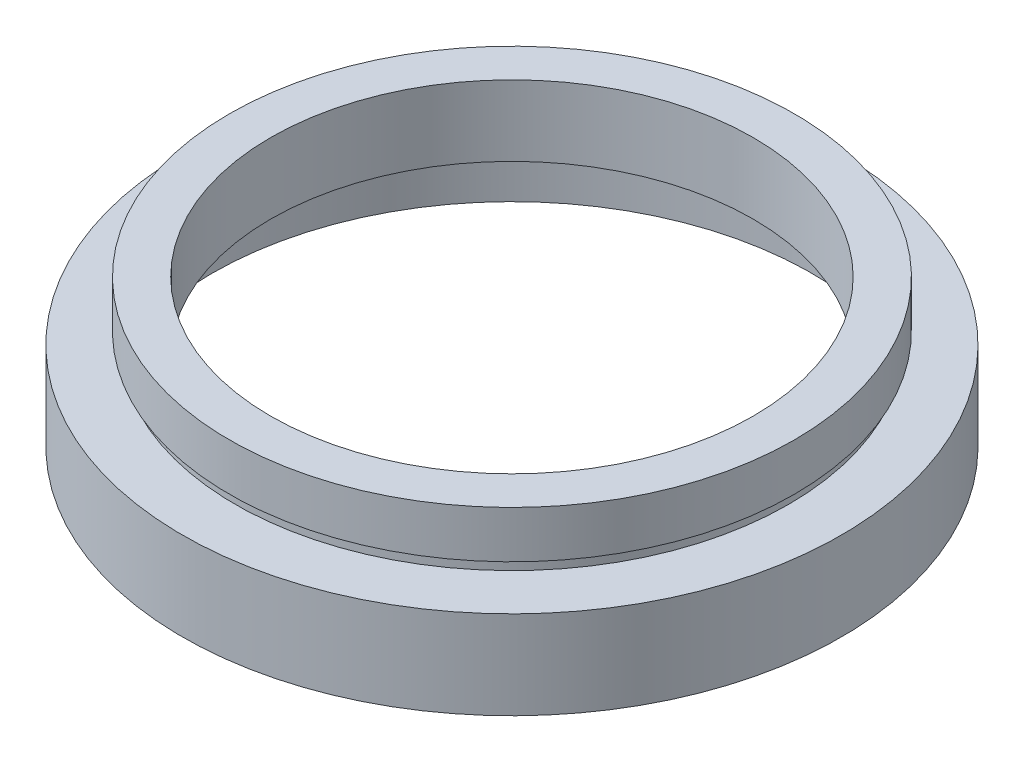
ISO-10303-21;
HEADER;
FILE_DESCRIPTION(('STEP AP214'),'2;1');
FILE_NAME('part.step','',(''),(''),'','','');
FILE_SCHEMA(('AUTOMOTIVE_DESIGN { 1 0 10303 214 1 1 1 1 }'));
ENDSEC;
DATA;
#1=APPLICATION_CONTEXT('core data for automotive mechanical design processes');
#2=APPLICATION_PROTOCOL_DEFINITION('international standard','automotive_design',2000,#1);
#3=PRODUCT_CONTEXT('',#1,'mechanical');
#4=PRODUCT('Part','Part','',(#3));
#5=PRODUCT_RELATED_PRODUCT_CATEGORY('part','',(#4));
#6=PRODUCT_DEFINITION_FORMATION('','',#4);
#7=PRODUCT_DEFINITION_CONTEXT('part definition',#1,'design');
#8=PRODUCT_DEFINITION('design','',#6,#7);
#9=PRODUCT_DEFINITION_SHAPE('','',#8);
#10=(LENGTH_UNIT() NAMED_UNIT(*) SI_UNIT(.MILLI.,.METRE.));
#11=(NAMED_UNIT(*) PLANE_ANGLE_UNIT() SI_UNIT($,.RADIAN.));
#12=(NAMED_UNIT(*) SI_UNIT($,.STERADIAN.) SOLID_ANGLE_UNIT());
#13=UNCERTAINTY_MEASURE_WITH_UNIT(LENGTH_MEASURE(1.E-05),#10,'distance_accuracy_value','');
#14=(GEOMETRIC_REPRESENTATION_CONTEXT(3) GLOBAL_UNCERTAINTY_ASSIGNED_CONTEXT((#13)) GLOBAL_UNIT_ASSIGNED_CONTEXT((#10,
#11,#12)) REPRESENTATION_CONTEXT('',''));
#15=CARTESIAN_POINT('',(0.,0.,0.));
#16=DIRECTION('',(0.,0.,1.));
#17=DIRECTION('',(1.,0.,0.));
#18=AXIS2_PLACEMENT_3D('',#15,#16,#17);
#19=CARTESIAN_POINT('',(28.,0.,0.));
#20=DIRECTION('',(0.,1.,0.));
#21=DIRECTION('',(-1.,0.,0.));
#22=AXIS2_PLACEMENT_3D('',#19,#20,#21);
#23=PLANE('',#22);
#24=CARTESIAN_POINT('',(0.,0.,0.));
#25=DIRECTION('',(0.,1.,0.));
#26=DIRECTION('',(-1.,0.,0.));
#27=AXIS2_PLACEMENT_3D('',#24,#25,#26);
#28=CIRCLE('',#27,28.);
#29=CARTESIAN_POINT('',(-28.,0.,0.));
#30=VERTEX_POINT('',#29);
#31=EDGE_CURVE('E75',#30,#30,#28,.T.);
#32=ORIENTED_EDGE('',*,*,#31,.F.);
#33=EDGE_LOOP('',(#32));
#34=FACE_BOUND('',#33,.T.);
#35=CARTESIAN_POINT('',(0.,0.,0.));
#36=DIRECTION('',(0.,1.,0.));
#37=DIRECTION('',(-1.,0.,0.));
#38=AXIS2_PLACEMENT_3D('',#35,#36,#37);
#39=CIRCLE('',#38,25.5);
#40=CARTESIAN_POINT('',(-25.5,0.,0.));
#41=VERTEX_POINT('',#40);
#42=EDGE_CURVE('E10',#41,#41,#39,.T.);
#43=ORIENTED_EDGE('',*,*,#42,.T.);
#44=EDGE_LOOP('',(#43));
#45=FACE_BOUND('',#44,.T.);
#46=ADVANCED_FACE('F35',(#34,#45),#23,.F.);
#47=CARTESIAN_POINT('',(0.,16.8860182370821,0.));
#48=DIRECTION('',(0.,1.,0.));
#49=DIRECTION('',(-1.,0.,0.));
#50=AXIS2_PLACEMENT_3D('',#47,#48,#49);
#51=CYLINDRICAL_SURFACE('',#50,25.5);
#52=ORIENTED_EDGE('',*,*,#42,.F.);
#53=EDGE_LOOP('',(#52));
#54=FACE_BOUND('',#53,.T.);
#55=CARTESIAN_POINT('',(0.,5.49999999999999,0.));
#56=DIRECTION('',(0.,1.,0.));
#57=DIRECTION('',(-1.,0.,0.));
#58=AXIS2_PLACEMENT_3D('',#55,#56,#57);
#59=CIRCLE('',#58,25.5);
#60=CARTESIAN_POINT('',(-25.5,5.49999999999999,0.));
#61=VERTEX_POINT('',#60);
#62=EDGE_CURVE('E41',#61,#61,#59,.T.);
#63=ORIENTED_EDGE('',*,*,#62,.T.);
#64=EDGE_LOOP('',(#63));
#65=FACE_BOUND('',#64,.T.);
#66=ADVANCED_FACE('F82',(#54,#65),#51,.F.);
#67=CARTESIAN_POINT('',(25.5,5.5,0.));
#68=DIRECTION('',(0.,-1.,0.));
#69=DIRECTION('',(1.,0.,0.));
#70=AXIS2_PLACEMENT_3D('',#67,#68,#69);
#71=PLANE('',#70);
#72=ORIENTED_EDGE('',*,*,#62,.F.);
#73=EDGE_LOOP('',(#72));
#74=FACE_BOUND('',#73,.T.);
#75=CARTESIAN_POINT('',(0.,5.49999999999999,0.));
#76=DIRECTION('',(0.,1.,0.));
#77=DIRECTION('',(-1.,0.,0.));
#78=AXIS2_PLACEMENT_3D('',#75,#76,#77);
#79=CIRCLE('',#78,26.1);
#80=CARTESIAN_POINT('',(-26.1,5.49999999999999,0.));
#81=VERTEX_POINT('',#80);
#82=EDGE_CURVE('E45',#81,#81,#79,.T.);
#83=ORIENTED_EDGE('',*,*,#82,.T.);
#84=EDGE_LOOP('',(#83));
#85=FACE_BOUND('',#84,.T.);
#86=ADVANCED_FACE('F86',(#74,#85),#71,.F.);
#87=CARTESIAN_POINT('',(0.,16.8860182370821,0.));
#88=DIRECTION('',(0.,1.,0.));
#89=DIRECTION('',(-1.,0.,0.));
#90=AXIS2_PLACEMENT_3D('',#87,#88,#89);
#91=CYLINDRICAL_SURFACE('',#90,26.1);
#92=ORIENTED_EDGE('',*,*,#82,.F.);
#93=EDGE_LOOP('',(#92));
#94=FACE_BOUND('',#93,.T.);
#95=CARTESIAN_POINT('',(0.,6.5,0.));
#96=DIRECTION('',(0.,1.,0.));
#97=DIRECTION('',(-1.,0.,0.));
#98=AXIS2_PLACEMENT_3D('',#95,#96,#97);
#99=CIRCLE('',#98,26.1);
#100=CARTESIAN_POINT('',(-26.1,6.49999999999999,0.));
#101=VERTEX_POINT('',#100);
#102=EDGE_CURVE('E49',#101,#101,#99,.T.);
#103=ORIENTED_EDGE('',*,*,#102,.T.);
#104=EDGE_LOOP('',(#103));
#105=FACE_BOUND('',#104,.T.);
#106=ADVANCED_FACE('F91',(#94,#105),#91,.F.);
#107=CARTESIAN_POINT('',(20.5,6.5,0.));
#108=DIRECTION('',(0.,1.,0.));
#109=DIRECTION('',(-1.,0.,0.));
#110=AXIS2_PLACEMENT_3D('',#107,#108,#109);
#111=PLANE('',#110);
#112=ORIENTED_EDGE('',*,*,#102,.F.);
#113=EDGE_LOOP('',(#112));
#114=FACE_BOUND('',#113,.T.);
#115=CARTESIAN_POINT('',(0.,6.5,0.));
#116=DIRECTION('',(0.,1.,0.));
#117=DIRECTION('',(-1.,0.,0.));
#118=AXIS2_PLACEMENT_3D('',#115,#116,#117);
#119=CIRCLE('',#118,20.5);
#120=CARTESIAN_POINT('',(-20.5,6.49999999999999,0.));
#121=VERTEX_POINT('',#120);
#122=EDGE_CURVE('E54',#121,#121,#119,.T.);
#123=ORIENTED_EDGE('',*,*,#122,.T.);
#124=EDGE_LOOP('',(#123));
#125=FACE_BOUND('',#124,.T.);
#126=ADVANCED_FACE('F97',(#114,#125),#111,.F.);
#127=CARTESIAN_POINT('',(0.,16.8860182370821,0.));
#128=DIRECTION('',(0.,1.,0.));
#129=DIRECTION('',(-1.,0.,0.));
#130=AXIS2_PLACEMENT_3D('',#127,#128,#129);
#131=CYLINDRICAL_SURFACE('',#130,20.5);
#132=ORIENTED_EDGE('',*,*,#122,.F.);
#133=EDGE_LOOP('',(#132));
#134=FACE_BOUND('',#133,.T.);
#135=CARTESIAN_POINT('',(0.,12.5,0.));
#136=DIRECTION('',(0.,1.,0.));
#137=DIRECTION('',(-1.,0.,0.));
#138=AXIS2_PLACEMENT_3D('',#135,#136,#137);
#139=CIRCLE('',#138,20.5);
#140=CARTESIAN_POINT('',(-20.5,12.5,0.));
#141=VERTEX_POINT('',#140);
#142=EDGE_CURVE('E57',#141,#141,#139,.T.);
#143=ORIENTED_EDGE('',*,*,#142,.T.);
#144=EDGE_LOOP('',(#143));
#145=FACE_BOUND('',#144,.T.);
#146=ADVANCED_FACE('F101',(#134,#145),#131,.F.);
#147=CARTESIAN_POINT('',(20.5,12.5,0.));
#148=DIRECTION('',(0.,-1.,0.));
#149=DIRECTION('',(1.,0.,0.));
#150=AXIS2_PLACEMENT_3D('',#147,#148,#149);
#151=PLANE('',#150);
#152=ORIENTED_EDGE('',*,*,#142,.F.);
#153=EDGE_LOOP('',(#152));
#154=FACE_BOUND('',#153,.T.);
#155=CARTESIAN_POINT('',(0.,12.5,0.));
#156=DIRECTION('',(0.,1.,0.));
#157=DIRECTION('',(-1.,0.,0.));
#158=AXIS2_PLACEMENT_3D('',#155,#156,#157);
#159=CIRCLE('',#158,24.);
#160=CARTESIAN_POINT('',(-24.,12.5,0.));
#161=VERTEX_POINT('',#160);
#162=EDGE_CURVE('E60',#161,#161,#159,.T.);
#163=ORIENTED_EDGE('',*,*,#162,.T.);
#164=EDGE_LOOP('',(#163));
#165=FACE_BOUND('',#164,.T.);
#166=ADVANCED_FACE('F105',(#154,#165),#151,.F.);
#167=CARTESIAN_POINT('',(0.,16.8860182370821,0.));
#168=DIRECTION('',(0.,1.,0.));
#169=DIRECTION('',(-1.,0.,0.));
#170=AXIS2_PLACEMENT_3D('',#167,#168,#169);
#171=CYLINDRICAL_SURFACE('',#170,24.);
#172=ORIENTED_EDGE('',*,*,#162,.F.);
#173=EDGE_LOOP('',(#172));
#174=FACE_BOUND('',#173,.T.);
#175=CARTESIAN_POINT('',(0.,8.5,0.));
#176=DIRECTION('',(0.,1.,0.));
#177=DIRECTION('',(-1.,0.,0.));
#178=AXIS2_PLACEMENT_3D('',#175,#176,#177);
#179=CIRCLE('',#178,24.);
#180=CARTESIAN_POINT('',(-24.,8.49999999999999,0.));
#181=VERTEX_POINT('',#180);
#182=EDGE_CURVE('E63',#181,#181,#179,.T.);
#183=ORIENTED_EDGE('',*,*,#182,.T.);
#184=EDGE_LOOP('',(#183));
#185=FACE_BOUND('',#184,.T.);
#186=ADVANCED_FACE('F109',(#174,#185),#171,.T.);
#187=CARTESIAN_POINT('',(24.,8.5,0.));
#188=DIRECTION('',(0.,1.,0.));
#189=DIRECTION('',(-1.,0.,0.));
#190=AXIS2_PLACEMENT_3D('',#187,#188,#189);
#191=PLANE('',#190);
#192=ORIENTED_EDGE('',*,*,#182,.F.);
#193=EDGE_LOOP('',(#192));
#194=FACE_BOUND('',#193,.T.);
#195=CARTESIAN_POINT('',(0.,8.5,0.));
#196=DIRECTION('',(0.,1.,0.));
#197=DIRECTION('',(-1.,0.,0.));
#198=AXIS2_PLACEMENT_3D('',#195,#196,#197);
#199=CIRCLE('',#198,23.5);
#200=CARTESIAN_POINT('',(-23.5,8.49999999999999,0.));
#201=VERTEX_POINT('',#200);
#202=EDGE_CURVE('E66',#201,#201,#199,.T.);
#203=ORIENTED_EDGE('',*,*,#202,.T.);
#204=EDGE_LOOP('',(#203));
#205=FACE_BOUND('',#204,.T.);
#206=ADVANCED_FACE('F113',(#194,#205),#191,.F.);
#207=CARTESIAN_POINT('',(0.,16.8860182370821,0.));
#208=DIRECTION('',(0.,1.,0.));
#209=DIRECTION('',(-1.,0.,0.));
#210=AXIS2_PLACEMENT_3D('',#207,#208,#209);
#211=CYLINDRICAL_SURFACE('',#210,23.5);
#212=ORIENTED_EDGE('',*,*,#202,.F.);
#213=EDGE_LOOP('',(#212));
#214=FACE_BOUND('',#213,.T.);
#215=CARTESIAN_POINT('',(0.,7.5,0.));
#216=DIRECTION('',(0.,1.,0.));
#217=DIRECTION('',(-1.,0.,0.));
#218=AXIS2_PLACEMENT_3D('',#215,#216,#217);
#219=CIRCLE('',#218,23.5);
#220=CARTESIAN_POINT('',(-23.5,7.49999999999999,0.));
#221=VERTEX_POINT('',#220);
#222=EDGE_CURVE('E69',#221,#221,#219,.T.);
#223=ORIENTED_EDGE('',*,*,#222,.T.);
#224=EDGE_LOOP('',(#223));
#225=FACE_BOUND('',#224,.T.);
#226=ADVANCED_FACE('F117',(#214,#225),#211,.T.);
#227=CARTESIAN_POINT('',(23.5,7.5,0.));
#228=DIRECTION('',(0.,-1.,0.));
#229=DIRECTION('',(1.,0.,0.));
#230=AXIS2_PLACEMENT_3D('',#227,#228,#229);
#231=PLANE('',#230);
#232=ORIENTED_EDGE('',*,*,#222,.F.);
#233=EDGE_LOOP('',(#232));
#234=FACE_BOUND('',#233,.T.);
#235=CARTESIAN_POINT('',(0.,7.5,0.));
#236=DIRECTION('',(0.,1.,0.));
#237=DIRECTION('',(-1.,0.,0.));
#238=AXIS2_PLACEMENT_3D('',#235,#236,#237);
#239=CIRCLE('',#238,28.);
#240=CARTESIAN_POINT('',(-28.,7.49999999999999,0.));
#241=VERTEX_POINT('',#240);
#242=EDGE_CURVE('E72',#241,#241,#239,.T.);
#243=ORIENTED_EDGE('',*,*,#242,.T.);
#244=EDGE_LOOP('',(#243));
#245=FACE_BOUND('',#244,.T.);
#246=ADVANCED_FACE('F121',(#234,#245),#231,.F.);
#247=CARTESIAN_POINT('',(0.,16.8860182370821,0.));
#248=DIRECTION('',(0.,1.,0.));
#249=DIRECTION('',(-1.,0.,0.));
#250=AXIS2_PLACEMENT_3D('',#247,#248,#249);
#251=CYLINDRICAL_SURFACE('',#250,28.);
#252=ORIENTED_EDGE('',*,*,#242,.F.);
#253=EDGE_LOOP('',(#252));
#254=FACE_BOUND('',#253,.T.);
#255=ORIENTED_EDGE('',*,*,#31,.T.);
#256=EDGE_LOOP('',(#255));
#257=FACE_BOUND('',#256,.T.);
#258=ADVANCED_FACE('F79',(#254,#257),#251,.T.);
#259=CLOSED_SHELL('',(#46,#66,#86,#106,#126,#146,#166,#186,#206,#226,#246,#258));
#260=MANIFOLD_SOLID_BREP('B2',#259);
#261=ADVANCED_BREP_SHAPE_REPRESENTATION('',(#18,#260),#14);
#262=SHAPE_DEFINITION_REPRESENTATION(#9,#261);
ENDSEC;
END-ISO-10303-21;
